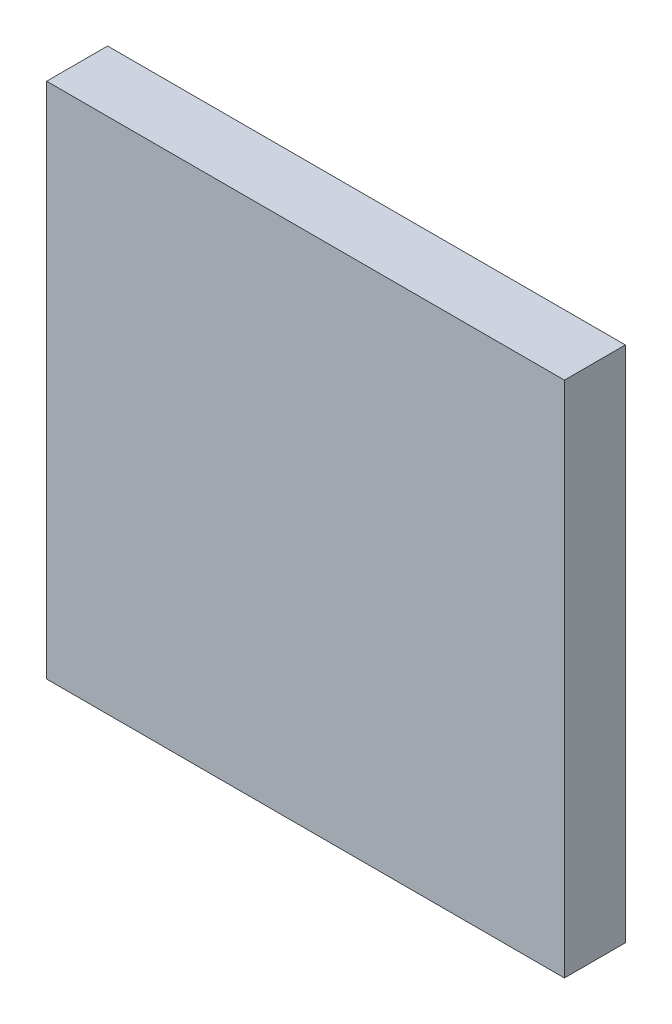
ISO-10303-21;
HEADER;
FILE_DESCRIPTION(('STEP AP214'),'2;1');
FILE_NAME('part.step','',(''),(''),'','','');
FILE_SCHEMA(('AUTOMOTIVE_DESIGN { 1 0 10303 214 1 1 1 1 }'));
ENDSEC;
DATA;
#1=APPLICATION_CONTEXT('core data for automotive mechanical design processes');
#2=APPLICATION_PROTOCOL_DEFINITION('international standard','automotive_design',2000,#1);
#3=PRODUCT_CONTEXT('',#1,'mechanical');
#4=PRODUCT('Part','Part','',(#3));
#5=PRODUCT_RELATED_PRODUCT_CATEGORY('part','',(#4));
#6=PRODUCT_DEFINITION_FORMATION('','',#4);
#7=PRODUCT_DEFINITION_CONTEXT('part definition',#1,'design');
#8=PRODUCT_DEFINITION('design','',#6,#7);
#9=PRODUCT_DEFINITION_SHAPE('','',#8);
#10=(LENGTH_UNIT() NAMED_UNIT(*) SI_UNIT(.MILLI.,.METRE.));
#11=(NAMED_UNIT(*) PLANE_ANGLE_UNIT() SI_UNIT($,.RADIAN.));
#12=(NAMED_UNIT(*) SI_UNIT($,.STERADIAN.) SOLID_ANGLE_UNIT());
#13=UNCERTAINTY_MEASURE_WITH_UNIT(LENGTH_MEASURE(1.E-05),#10,'distance_accuracy_value','');
#14=(GEOMETRIC_REPRESENTATION_CONTEXT(3) GLOBAL_UNCERTAINTY_ASSIGNED_CONTEXT((#13)) GLOBAL_UNIT_ASSIGNED_CONTEXT((#10,
#11,#12)) REPRESENTATION_CONTEXT('',''));
#15=CARTESIAN_POINT('',(0.,0.,0.));
#16=DIRECTION('',(0.,0.,1.));
#17=DIRECTION('',(1.,0.,0.));
#18=AXIS2_PLACEMENT_3D('',#15,#16,#17);
#19=CARTESIAN_POINT('',(0.,0.,0.729999999999874));
#20=DIRECTION('',(0.,0.,1.));
#21=DIRECTION('',(1.,0.,0.));
#22=AXIS2_PLACEMENT_3D('',#19,#20,#21);
#23=PLANE('',#22);
#24=DIRECTION('',(0.,1.,0.));
#25=VECTOR('',#24,1.);
#26=CARTESIAN_POINT('',(-3.1000000000003,3.1000000000003,0.729999999999874));
#27=LINE('',#26,#25);
#28=CARTESIAN_POINT('',(-3.1000000000003,-3.1000000000003,0.729999999999874));
#29=VERTEX_POINT('',#28);
#30=CARTESIAN_POINT('',(-3.1000000000003,3.1000000000003,0.729999999999874));
#31=VERTEX_POINT('',#30);
#32=EDGE_CURVE('E68',#29,#31,#27,.T.);
#33=ORIENTED_EDGE('',*,*,#32,.F.);
#34=DIRECTION('',(1.,0.,0.));
#35=VECTOR('',#34,1.);
#36=CARTESIAN_POINT('',(-3.1000000000003,-3.1000000000003,0.729999999999874));
#37=LINE('',#36,#35);
#38=CARTESIAN_POINT('',(3.1000000000003,-3.1000000000003,0.729999999999874));
#39=VERTEX_POINT('',#38);
#40=EDGE_CURVE('E20',#39,#29,#37,.F.);
#41=ORIENTED_EDGE('',*,*,#40,.F.);
#42=DIRECTION('',(0.,1.,0.));
#43=VECTOR('',#42,1.);
#44=CARTESIAN_POINT('',(3.1000000000003,-3.1000000000003,0.729999999999874));
#45=LINE('',#44,#43);
#46=CARTESIAN_POINT('',(3.1000000000003,3.1000000000003,0.729999999999874));
#47=VERTEX_POINT('',#46);
#48=EDGE_CURVE('E58',#47,#39,#45,.F.);
#49=ORIENTED_EDGE('',*,*,#48,.F.);
#50=DIRECTION('',(1.,0.,0.));
#51=VECTOR('',#50,1.);
#52=CARTESIAN_POINT('',(3.1000000000003,3.1000000000003,0.729999999999874));
#53=LINE('',#52,#51);
#54=EDGE_CURVE('E53',#31,#47,#53,.T.);
#55=ORIENTED_EDGE('',*,*,#54,.F.);
#56=EDGE_LOOP('',(#33,#41,#49,#55));
#57=FACE_BOUND('',#56,.T.);
#58=ADVANCED_FACE('F17',(#57),#23,.T.);
#59=CARTESIAN_POINT('',(-3.1000000000003,-3.1000000000003,0.));
#60=DIRECTION('',(0.,-1.,0.));
#61=DIRECTION('',(0.,0.,-1.));
#62=AXIS2_PLACEMENT_3D('',#59,#60,#61);
#63=PLANE('',#62);
#64=DIRECTION('',(0.,0.,1.));
#65=VECTOR('',#64,1.);
#66=CARTESIAN_POINT('',(-3.1000000000003,-3.1000000000003,0.));
#67=LINE('',#66,#65);
#68=CARTESIAN_POINT('',(-3.1000000000003,-3.1000000000003,0.));
#69=VERTEX_POINT('',#68);
#70=EDGE_CURVE('E79',#69,#29,#67,.T.);
#71=ORIENTED_EDGE('',*,*,#70,.F.);
#72=DIRECTION('',(1.,0.,0.));
#73=VECTOR('',#72,1.);
#74=CARTESIAN_POINT('',(0.,-3.1000000000003,0.));
#75=LINE('',#74,#73);
#76=CARTESIAN_POINT('',(3.1000000000003,-3.1000000000003,0.));
#77=VERTEX_POINT('',#76);
#78=EDGE_CURVE('E74',#69,#77,#75,.T.);
#79=ORIENTED_EDGE('',*,*,#78,.T.);
#80=DIRECTION('',(0.,0.,-1.));
#81=VECTOR('',#80,1.);
#82=CARTESIAN_POINT('',(3.1000000000003,-3.1000000000003,0.));
#83=LINE('',#82,#81);
#84=EDGE_CURVE('E63',#39,#77,#83,.T.);
#85=ORIENTED_EDGE('',*,*,#84,.F.);
#86=ORIENTED_EDGE('',*,*,#40,.T.);
#87=EDGE_LOOP('',(#71,#79,#85,#86));
#88=FACE_BOUND('',#87,.T.);
#89=ADVANCED_FACE('F73',(#88),#63,.T.);
#90=CARTESIAN_POINT('',(3.1000000000003,-3.1000000000003,0.));
#91=DIRECTION('',(1.,0.,0.));
#92=DIRECTION('',(0.,0.,-1.));
#93=AXIS2_PLACEMENT_3D('',#90,#91,#92);
#94=PLANE('',#93);
#95=ORIENTED_EDGE('',*,*,#84,.T.);
#96=DIRECTION('',(0.,1.,0.));
#97=VECTOR('',#96,1.);
#98=CARTESIAN_POINT('',(3.1000000000003,0.,0.));
#99=LINE('',#98,#97);
#100=CARTESIAN_POINT('',(3.1000000000003,3.1000000000003,0.));
#101=VERTEX_POINT('',#100);
#102=EDGE_CURVE('E84',#77,#101,#99,.T.);
#103=ORIENTED_EDGE('',*,*,#102,.T.);
#104=DIRECTION('',(0.,0.,1.));
#105=VECTOR('',#104,1.);
#106=CARTESIAN_POINT('',(3.1000000000003,3.1000000000003,0.));
#107=LINE('',#106,#105);
#108=EDGE_CURVE('E65',#47,#101,#107,.F.);
#109=ORIENTED_EDGE('',*,*,#108,.F.);
#110=ORIENTED_EDGE('',*,*,#48,.T.);
#111=EDGE_LOOP('',(#95,#103,#109,#110));
#112=FACE_BOUND('',#111,.T.);
#113=ADVANCED_FACE('F60',(#112),#94,.T.);
#114=CARTESIAN_POINT('',(3.1000000000003,3.1000000000003,0.));
#115=DIRECTION('',(0.,1.,0.));
#116=DIRECTION('',(0.,0.,1.));
#117=AXIS2_PLACEMENT_3D('',#114,#115,#116);
#118=PLANE('',#117);
#119=ORIENTED_EDGE('',*,*,#108,.T.);
#120=DIRECTION('',(1.,0.,0.));
#121=VECTOR('',#120,1.);
#122=CARTESIAN_POINT('',(0.,3.1000000000003,0.));
#123=LINE('',#122,#121);
#124=CARTESIAN_POINT('',(-3.1000000000003,3.1000000000003,0.));
#125=VERTEX_POINT('',#124);
#126=EDGE_CURVE('E26',#101,#125,#123,.F.);
#127=ORIENTED_EDGE('',*,*,#126,.T.);
#128=DIRECTION('',(0.,0.,1.));
#129=VECTOR('',#128,1.);
#130=CARTESIAN_POINT('',(-3.1000000000003,3.1000000000003,0.));
#131=LINE('',#130,#129);
#132=EDGE_CURVE('E34',#31,#125,#131,.F.);
#133=ORIENTED_EDGE('',*,*,#132,.F.);
#134=ORIENTED_EDGE('',*,*,#54,.T.);
#135=EDGE_LOOP('',(#119,#127,#133,#134));
#136=FACE_BOUND('',#135,.T.);
#137=ADVANCED_FACE('F88',(#136),#118,.T.);
#138=CARTESIAN_POINT('',(-3.1000000000003,3.1000000000003,0.));
#139=DIRECTION('',(-1.,0.,0.));
#140=DIRECTION('',(0.,0.,1.));
#141=AXIS2_PLACEMENT_3D('',#138,#139,#140);
#142=PLANE('',#141);
#143=ORIENTED_EDGE('',*,*,#132,.T.);
#144=DIRECTION('',(0.,1.,0.));
#145=VECTOR('',#144,1.);
#146=CARTESIAN_POINT('',(-3.1000000000003,0.,0.));
#147=LINE('',#146,#145);
#148=EDGE_CURVE('E11',#125,#69,#147,.F.);
#149=ORIENTED_EDGE('',*,*,#148,.T.);
#150=ORIENTED_EDGE('',*,*,#70,.T.);
#151=ORIENTED_EDGE('',*,*,#32,.T.);
#152=EDGE_LOOP('',(#143,#149,#150,#151));
#153=FACE_BOUND('',#152,.T.);
#154=ADVANCED_FACE('F91',(#153),#142,.T.);
#155=CARTESIAN_POINT('',(0.,0.,0.));
#156=DIRECTION('',(0.,0.,1.));
#157=DIRECTION('',(1.,0.,0.));
#158=AXIS2_PLACEMENT_3D('',#155,#156,#157);
#159=PLANE('',#158);
#160=ORIENTED_EDGE('',*,*,#126,.F.);
#161=ORIENTED_EDGE('',*,*,#102,.F.);
#162=ORIENTED_EDGE('',*,*,#78,.F.);
#163=ORIENTED_EDGE('',*,*,#148,.F.);
#164=EDGE_LOOP('',(#160,#161,#162,#163));
#165=FACE_BOUND('',#164,.T.);
#166=ADVANCED_FACE('F90',(#165),#159,.F.);
#167=CLOSED_SHELL('',(#58,#89,#113,#137,#154,#166));
#168=MANIFOLD_SOLID_BREP('B1',#167);
#169=ADVANCED_BREP_SHAPE_REPRESENTATION('',(#18,#168),#14);
#170=SHAPE_DEFINITION_REPRESENTATION(#9,#169);
ENDSEC;
END-ISO-10303-21;
